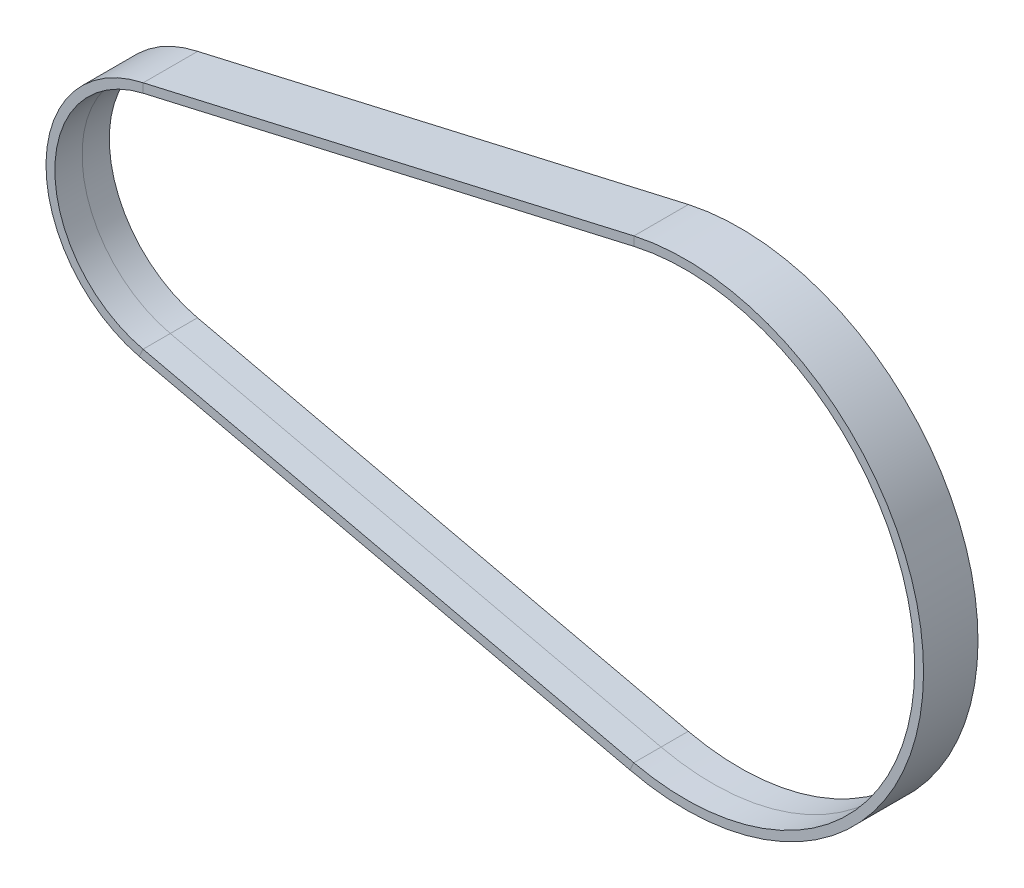
ISO-10303-21;
HEADER;
FILE_DESCRIPTION(('STEP AP214'),'2;1');
FILE_NAME('part.step','',(''),(''),'','','');
FILE_SCHEMA(('AUTOMOTIVE_DESIGN { 1 0 10303 214 1 1 1 1 }'));
ENDSEC;
DATA;
#1=APPLICATION_CONTEXT('core data for automotive mechanical design processes');
#2=APPLICATION_PROTOCOL_DEFINITION('international standard','automotive_design',2000,#1);
#3=PRODUCT_CONTEXT('',#1,'mechanical');
#4=PRODUCT('Part','Part','',(#3));
#5=PRODUCT_RELATED_PRODUCT_CATEGORY('part','',(#4));
#6=PRODUCT_DEFINITION_FORMATION('','',#4);
#7=PRODUCT_DEFINITION_CONTEXT('part definition',#1,'design');
#8=PRODUCT_DEFINITION('design','',#6,#7);
#9=PRODUCT_DEFINITION_SHAPE('','',#8);
#10=(LENGTH_UNIT() NAMED_UNIT(*) SI_UNIT(.MILLI.,.METRE.));
#11=(NAMED_UNIT(*) PLANE_ANGLE_UNIT() SI_UNIT($,.RADIAN.));
#12=(NAMED_UNIT(*) SI_UNIT($,.STERADIAN.) SOLID_ANGLE_UNIT());
#13=UNCERTAINTY_MEASURE_WITH_UNIT(LENGTH_MEASURE(1.E-05),#10,'distance_accuracy_value','');
#14=(GEOMETRIC_REPRESENTATION_CONTEXT(3) GLOBAL_UNCERTAINTY_ASSIGNED_CONTEXT((#13)) GLOBAL_UNIT_ASSIGNED_CONTEXT((#10,
#11,#12)) REPRESENTATION_CONTEXT('',''));
#15=CARTESIAN_POINT('',(0.,0.,0.));
#16=DIRECTION('',(0.,0.,1.));
#17=DIRECTION('',(1.,0.,0.));
#18=AXIS2_PLACEMENT_3D('',#15,#16,#17);
#19=CARTESIAN_POINT('',(-3.25164833273085,-13.1156696536498,-3.));
#20=DIRECTION('',(0.,0.,-1.));
#21=DIRECTION('',(-1.,0.,0.));
#22=AXIS2_PLACEMENT_3D('',#19,#20,#21);
#23=PLANE('',#22);
#24=CARTESIAN_POINT('',(0.,0.,-3.));
#25=DIRECTION('',(0.,0.,-1.));
#26=DIRECTION('',(-0.22456525321064,-0.974459053552503,0.));
#27=AXIS2_PLACEMENT_3D('',#24,#25,#26);
#28=CIRCLE('',#27,12.5361346548221);
#29=CARTESIAN_POINT('',(-2.8151802530428,-12.2159499109446,-3.));
#30=VERTEX_POINT('',#29);
#31=CARTESIAN_POINT('',(-2.79899894625922,12.2196676297954,-3.));
#32=VERTEX_POINT('',#31);
#33=EDGE_CURVE('E11',#30,#32,#28,.T.);
#34=ORIENTED_EDGE('',*,*,#33,.F.);
#35=DIRECTION('',(-0.436468079688057,-0.899719742705149,0.));
#36=VECTOR('',#35,1.);
#37=CARTESIAN_POINT('',(-3.25164833273085,-13.1156696536498,-3.));
#38=LINE('',#37,#36);
#39=CARTESIAN_POINT('',(-3.25164833273086,-13.1156696536498,-3.));
#40=VERTEX_POINT('',#39);
#41=EDGE_CURVE('E42',#30,#40,#38,.T.);
#42=ORIENTED_EDGE('',*,*,#41,.T.);
#43=CARTESIAN_POINT('',(0.,0.,-3.));
#44=DIRECTION('',(0.,0.,-1.));
#45=DIRECTION('',(-0.24063583954527,-0.970615471093648,0.));
#46=AXIS2_PLACEMENT_3D('',#43,#44,#45);
#47=CIRCLE('',#46,13.5127350060386);
#48=CARTESIAN_POINT('',(-2.79899894625922,13.2196676297954,-3.));
#49=VERTEX_POINT('',#48);
#50=EDGE_CURVE('E143',#40,#49,#47,.T.);
#51=ORIENTED_EDGE('',*,*,#50,.T.);
#52=DIRECTION('',(0.,1.,0.));
#53=VECTOR('',#52,1.);
#54=CARTESIAN_POINT('',(-2.79899894625922,13.2196676297954,-3.));
#55=LINE('',#54,#53);
#56=EDGE_CURVE('E146',#32,#49,#55,.T.);
#57=ORIENTED_EDGE('',*,*,#56,.F.);
#58=EDGE_LOOP('',(#34,#42,#51,#57));
#59=FACE_BOUND('',#58,.T.);
#60=ADVANCED_FACE('F39',(#59),#23,.T.);
#61=CARTESIAN_POINT('',(0.,0.,0.));
#62=DIRECTION('',(0.,0.,-1.));
#63=DIRECTION('',(-1.,0.,0.));
#64=AXIS2_PLACEMENT_3D('',#61,#62,#63);
#65=CYLINDRICAL_SURFACE('',#64,12.5361346548221);
#66=CARTESIAN_POINT('',(0.,0.,0.));
#67=DIRECTION('',(0.,0.,-1.));
#68=DIRECTION('',(-0.22456525321064,-0.974459053552503,0.));
#69=AXIS2_PLACEMENT_3D('',#66,#67,#68);
#70=CIRCLE('',#69,12.5361346548221);
#71=CARTESIAN_POINT('',(-2.8151802530428,-12.2159499109446,0.));
#72=VERTEX_POINT('',#71);
#73=CARTESIAN_POINT('',(-2.79899894625922,12.2196676297954,0.));
#74=VERTEX_POINT('',#73);
#75=EDGE_CURVE('E48',#72,#74,#70,.T.);
#76=ORIENTED_EDGE('',*,*,#75,.F.);
#77=DIRECTION('',(0.,0.,-1.));
#78=VECTOR('',#77,1.);
#79=CARTESIAN_POINT('',(-2.81518025304279,-12.2159499109446,-3.));
#80=LINE('',#79,#78);
#81=EDGE_CURVE('E258',#72,#30,#80,.T.);
#82=ORIENTED_EDGE('',*,*,#81,.T.);
#83=ORIENTED_EDGE('',*,*,#33,.T.);
#84=DIRECTION('',(0.,0.,-1.));
#85=VECTOR('',#84,1.);
#86=CARTESIAN_POINT('',(-2.79899894625922,12.2196676297954,-3.));
#87=LINE('',#86,#85);
#88=EDGE_CURVE('E170',#74,#32,#87,.T.);
#89=ORIENTED_EDGE('',*,*,#88,.F.);
#90=EDGE_LOOP('',(#76,#82,#83,#89));
#91=FACE_BOUND('',#90,.T.);
#92=ADVANCED_FACE('F310',(#91),#65,.F.);
#93=CARTESIAN_POINT('',(0.,0.,0.));
#94=DIRECTION('',(0.,0.,-1.));
#95=DIRECTION('',(-1.,0.,0.));
#96=AXIS2_PLACEMENT_3D('',#93,#94,#95);
#97=CYLINDRICAL_SURFACE('',#96,12.5361346548221);
#98=CARTESIAN_POINT('',(0.,0.,3.));
#99=DIRECTION('',(0.,0.,-1.));
#100=DIRECTION('',(-0.22456525321064,-0.974459053552503,0.));
#101=AXIS2_PLACEMENT_3D('',#98,#99,#100);
#102=CIRCLE('',#101,12.5361346548221);
#103=CARTESIAN_POINT('',(-2.8151802530428,-12.2159499109446,3.));
#104=VERTEX_POINT('',#103);
#105=CARTESIAN_POINT('',(-2.79899894625922,12.2196676297954,3.));
#106=VERTEX_POINT('',#105);
#107=EDGE_CURVE('E132',#104,#106,#102,.T.);
#108=ORIENTED_EDGE('',*,*,#107,.F.);
#109=DIRECTION('',(0.,0.,-1.));
#110=VECTOR('',#109,1.);
#111=CARTESIAN_POINT('',(-2.81518025304279,-12.2159499109446,0.));
#112=LINE('',#111,#110);
#113=EDGE_CURVE('E232',#104,#72,#112,.T.);
#114=ORIENTED_EDGE('',*,*,#113,.T.);
#115=ORIENTED_EDGE('',*,*,#75,.T.);
#116=DIRECTION('',(0.,0.,-1.));
#117=VECTOR('',#116,1.);
#118=CARTESIAN_POINT('',(-2.79899894625922,12.2196676297954,0.));
#119=LINE('',#118,#117);
#120=EDGE_CURVE('E178',#106,#74,#119,.T.);
#121=ORIENTED_EDGE('',*,*,#120,.F.);
#122=EDGE_LOOP('',(#108,#114,#115,#121));
#123=FACE_BOUND('',#122,.T.);
#124=ADVANCED_FACE('F314',(#123),#97,.F.);
#125=CARTESIAN_POINT('',(-2.8151802530428,-12.2159499109446,3.));
#126=DIRECTION('',(0.,0.,1.));
#127=DIRECTION('',(1.,0.,0.));
#128=AXIS2_PLACEMENT_3D('',#125,#126,#127);
#129=PLANE('',#128);
#130=CARTESIAN_POINT('',(0.,0.,3.));
#131=DIRECTION('',(0.,0.,-1.));
#132=DIRECTION('',(-0.24063583954527,-0.970615471093648,0.));
#133=AXIS2_PLACEMENT_3D('',#130,#131,#132);
#134=CIRCLE('',#133,13.5127350060386);
#135=CARTESIAN_POINT('',(-3.25164833273086,-13.1156696536498,3.));
#136=VERTEX_POINT('',#135);
#137=CARTESIAN_POINT('',(-2.79899894625922,13.2196676297954,3.));
#138=VERTEX_POINT('',#137);
#139=EDGE_CURVE('E139',#136,#138,#134,.T.);
#140=ORIENTED_EDGE('',*,*,#139,.F.);
#141=DIRECTION('',(0.436468079688057,0.899719742705149,0.));
#142=VECTOR('',#141,1.);
#143=CARTESIAN_POINT('',(-2.81518025304279,-12.2159499109446,3.));
#144=LINE('',#143,#142);
#145=EDGE_CURVE('E206',#136,#104,#144,.T.);
#146=ORIENTED_EDGE('',*,*,#145,.T.);
#147=ORIENTED_EDGE('',*,*,#107,.T.);
#148=DIRECTION('',(0.,-1.,0.));
#149=VECTOR('',#148,1.);
#150=CARTESIAN_POINT('',(-2.79899894625922,12.2196676297954,3.));
#151=LINE('',#150,#149);
#152=EDGE_CURVE('E174',#138,#106,#151,.T.);
#153=ORIENTED_EDGE('',*,*,#152,.F.);
#154=EDGE_LOOP('',(#140,#146,#147,#153));
#155=FACE_BOUND('',#154,.T.);
#156=ADVANCED_FACE('F319',(#155),#129,.T.);
#157=CARTESIAN_POINT('',(50.8333727420847,-25.5419158823688,-3.));
#158=DIRECTION('',(0.,0.,-1.));
#159=DIRECTION('',(-1.,0.,0.));
#160=AXIS2_PLACEMENT_3D('',#157,#158,#159);
#161=PLANE('',#160);
#162=ORIENTED_EDGE('',*,*,#41,.F.);
#163=DIRECTION('',(-0.974607547350509,0.223919915700738,0.));
#164=VECTOR('',#163,1.);
#165=CARTESIAN_POINT('',(51.2698408217728,-24.6421961396636,-3.));
#166=LINE('',#165,#164);
#167=CARTESIAN_POINT('',(51.2698408217728,-24.6421961396636,-3.));
#168=VERTEX_POINT('',#167);
#169=EDGE_CURVE('E274',#168,#30,#166,.T.);
#170=ORIENTED_EDGE('',*,*,#169,.F.);
#171=DIRECTION('',(-0.436468079688057,-0.899719742705149,0.));
#172=VECTOR('',#171,1.);
#173=CARTESIAN_POINT('',(50.8333727420847,-25.5419158823688,-3.));
#174=LINE('',#173,#172);
#175=CARTESIAN_POINT('',(50.8333727420848,-25.5419158823688,-3.));
#176=VERTEX_POINT('',#175);
#177=EDGE_CURVE('E210',#168,#176,#174,.T.);
#178=ORIENTED_EDGE('',*,*,#177,.T.);
#179=DIRECTION('',(-0.974607547350509,0.223919915700738,0.));
#180=VECTOR('',#179,1.);
#181=CARTESIAN_POINT('',(50.8333727420847,-25.5419158823688,-3.));
#182=LINE('',#181,#180);
#183=EDGE_CURVE('E202',#176,#40,#182,.T.);
#184=ORIENTED_EDGE('',*,*,#183,.T.);
#185=EDGE_LOOP('',(#162,#170,#178,#184));
#186=FACE_BOUND('',#185,.T.);
#187=ADVANCED_FACE('F285',(#186),#161,.T.);
#188=CARTESIAN_POINT('',(51.2698408217728,-24.6421961396636,-3.));
#189=DIRECTION('',(0.223919915700738,0.974607547350509,0.));
#190=DIRECTION('',(-0.974607547350509,0.223919915700738,0.));
#191=AXIS2_PLACEMENT_3D('',#188,#189,#190);
#192=PLANE('',#191);
#193=ORIENTED_EDGE('',*,*,#169,.T.);
#194=ORIENTED_EDGE('',*,*,#81,.F.);
#195=DIRECTION('',(-0.974607547350509,0.223919915700738,0.));
#196=VECTOR('',#195,1.);
#197=CARTESIAN_POINT('',(51.2698408217728,-24.6421961396636,0.));
#198=LINE('',#197,#196);
#199=CARTESIAN_POINT('',(51.2698408217728,-24.6421961396636,0.));
#200=VERTEX_POINT('',#199);
#201=EDGE_CURVE('E254',#200,#72,#198,.T.);
#202=ORIENTED_EDGE('',*,*,#201,.F.);
#203=DIRECTION('',(0.,0.,-1.));
#204=VECTOR('',#203,1.);
#205=CARTESIAN_POINT('',(51.2698408217728,-24.6421961396636,-3.));
#206=LINE('',#205,#204);
#207=EDGE_CURVE('E248',#200,#168,#206,.T.);
#208=ORIENTED_EDGE('',*,*,#207,.T.);
#209=EDGE_LOOP('',(#193,#194,#202,#208));
#210=FACE_BOUND('',#209,.T.);
#211=ADVANCED_FACE('F324',(#210),#192,.T.);
#212=CARTESIAN_POINT('',(51.2698408217728,-24.6421961396636,0.));
#213=DIRECTION('',(0.223919915700738,0.974607547350509,0.));
#214=DIRECTION('',(-0.974607547350509,0.223919915700738,0.));
#215=AXIS2_PLACEMENT_3D('',#212,#213,#214);
#216=PLANE('',#215);
#217=ORIENTED_EDGE('',*,*,#201,.T.);
#218=ORIENTED_EDGE('',*,*,#113,.F.);
#219=DIRECTION('',(-0.974607547350509,0.223919915700738,0.));
#220=VECTOR('',#219,1.);
#221=CARTESIAN_POINT('',(51.2698408217728,-24.6421961396636,3.));
#222=LINE('',#221,#220);
#223=CARTESIAN_POINT('',(51.2698408217728,-24.6421961396636,3.));
#224=VERTEX_POINT('',#223);
#225=EDGE_CURVE('E228',#224,#104,#222,.T.);
#226=ORIENTED_EDGE('',*,*,#225,.F.);
#227=DIRECTION('',(0.,0.,-1.));
#228=VECTOR('',#227,1.);
#229=CARTESIAN_POINT('',(51.2698408217728,-24.6421961396636,0.));
#230=LINE('',#229,#228);
#231=EDGE_CURVE('E223',#224,#200,#230,.T.);
#232=ORIENTED_EDGE('',*,*,#231,.T.);
#233=EDGE_LOOP('',(#217,#218,#226,#232));
#234=FACE_BOUND('',#233,.T.);
#235=ADVANCED_FACE('F336',(#234),#216,.T.);
#236=CARTESIAN_POINT('',(51.2698408217728,-24.6421961396636,3.));
#237=DIRECTION('',(0.,0.,1.));
#238=DIRECTION('',(1.,0.,0.));
#239=AXIS2_PLACEMENT_3D('',#236,#237,#238);
#240=PLANE('',#239);
#241=ORIENTED_EDGE('',*,*,#225,.T.);
#242=ORIENTED_EDGE('',*,*,#145,.F.);
#243=DIRECTION('',(-0.974607547350509,0.223919915700738,0.));
#244=VECTOR('',#243,1.);
#245=CARTESIAN_POINT('',(50.8333727420847,-25.5419158823688,3.));
#246=LINE('',#245,#244);
#247=CARTESIAN_POINT('',(50.8333727420848,-25.5419158823688,3.));
#248=VERTEX_POINT('',#247);
#249=EDGE_CURVE('E201',#248,#136,#246,.T.);
#250=ORIENTED_EDGE('',*,*,#249,.F.);
#251=DIRECTION('',(0.436468079688057,0.899719742705149,0.));
#252=VECTOR('',#251,1.);
#253=CARTESIAN_POINT('',(51.2698408217728,-24.6421961396636,3.));
#254=LINE('',#253,#252);
#255=EDGE_CURVE('E191',#248,#224,#254,.T.);
#256=ORIENTED_EDGE('',*,*,#255,.T.);
#257=EDGE_LOOP('',(#241,#242,#250,#256));
#258=FACE_BOUND('',#257,.T.);
#259=ADVANCED_FACE('F295',(#258),#240,.T.);
#260=CARTESIAN_POINT('',(50.8333727420847,-25.5419158823688,3.));
#261=DIRECTION('',(-0.223919915700738,-0.974607547350509,0.));
#262=DIRECTION('',(0.974607547350509,-0.223919915700738,0.));
#263=AXIS2_PLACEMENT_3D('',#260,#261,#262);
#264=PLANE('',#263);
#265=ORIENTED_EDGE('',*,*,#249,.T.);
#266=DIRECTION('',(0.,0.,1.));
#267=VECTOR('',#266,1.);
#268=CARTESIAN_POINT('',(-3.25164833273085,-13.1156696536498,3.));
#269=LINE('',#268,#267);
#270=EDGE_CURVE('E198',#40,#136,#269,.T.);
#271=ORIENTED_EDGE('',*,*,#270,.F.);
#272=ORIENTED_EDGE('',*,*,#183,.F.);
#273=DIRECTION('',(0.,0.,1.));
#274=VECTOR('',#273,1.);
#275=CARTESIAN_POINT('',(50.8333727420847,-25.5419158823688,3.));
#276=LINE('',#275,#274);
#277=EDGE_CURVE('E187',#176,#248,#276,.T.);
#278=ORIENTED_EDGE('',*,*,#277,.T.);
#279=EDGE_LOOP('',(#265,#271,#272,#278));
#280=FACE_BOUND('',#279,.T.);
#281=ADVANCED_FACE('F292',(#280),#264,.T.);
#282=CARTESIAN_POINT('',(51.2860221285564,25.6459138585144,-3.));
#283=DIRECTION('',(0.,0.,-1.));
#284=DIRECTION('',(-1.,0.,0.));
#285=AXIS2_PLACEMENT_3D('',#282,#283,#284);
#286=PLANE('',#285);
#287=ORIENTED_EDGE('',*,*,#177,.F.);
#288=CARTESIAN_POINT('',(56.94,0.,-3.));
#289=DIRECTION('',(0.,0.,-1.));
#290=DIRECTION('',(-0.223599939592176,0.974681007824804,0.));
#291=AXIS2_PLACEMENT_3D('',#288,#289,#290);
#292=CIRCLE('',#291,25.2861332688904);
#293=CARTESIAN_POINT('',(51.2860221285564,24.6459138585144,-3.));
#294=VERTEX_POINT('',#293);
#295=EDGE_CURVE('E85',#294,#168,#292,.T.);
#296=ORIENTED_EDGE('',*,*,#295,.F.);
#297=DIRECTION('',(0.,1.,0.));
#298=VECTOR('',#297,1.);
#299=CARTESIAN_POINT('',(51.2860221285564,25.6459138585144,-3.));
#300=LINE('',#299,#298);
#301=CARTESIAN_POINT('',(51.2860221285564,25.6459138585144,-3.));
#302=VERTEX_POINT('',#301);
#303=EDGE_CURVE('E197',#294,#302,#300,.T.);
#304=ORIENTED_EDGE('',*,*,#303,.T.);
#305=CARTESIAN_POINT('',(56.94,0.,-3.));
#306=DIRECTION('',(0.,0.,-1.));
#307=DIRECTION('',(-0.215293131108368,0.976549470174223,0.));
#308=AXIS2_PLACEMENT_3D('',#305,#306,#307);
#309=CIRCLE('',#308,26.2617661898265);
#310=EDGE_CURVE('E194',#302,#176,#309,.T.);
#311=ORIENTED_EDGE('',*,*,#310,.T.);
#312=EDGE_LOOP('',(#287,#296,#304,#311));
#313=FACE_BOUND('',#312,.T.);
#314=ADVANCED_FACE('F329',(#313),#286,.T.);
#315=CARTESIAN_POINT('',(56.94,0.,0.));
#316=DIRECTION('',(0.,0.,-1.));
#317=DIRECTION('',(-1.,0.,0.));
#318=AXIS2_PLACEMENT_3D('',#315,#316,#317);
#319=CYLINDRICAL_SURFACE('',#318,25.2861332688904);
#320=ORIENTED_EDGE('',*,*,#295,.T.);
#321=ORIENTED_EDGE('',*,*,#207,.F.);
#322=CARTESIAN_POINT('',(56.94,0.,0.));
#323=DIRECTION('',(0.,0.,-1.));
#324=DIRECTION('',(-0.223599939592176,0.974681007824804,0.));
#325=AXIS2_PLACEMENT_3D('',#322,#323,#324);
#326=CIRCLE('',#325,25.2861332688904);
#327=CARTESIAN_POINT('',(51.2860221285564,24.6459138585144,0.));
#328=VERTEX_POINT('',#327);
#329=EDGE_CURVE('E95',#328,#200,#326,.T.);
#330=ORIENTED_EDGE('',*,*,#329,.F.);
#331=DIRECTION('',(0.,0.,-1.));
#332=VECTOR('',#331,1.);
#333=CARTESIAN_POINT('',(51.2860221285564,24.6459138585144,-3.));
#334=LINE('',#333,#332);
#335=EDGE_CURVE('E244',#328,#294,#334,.T.);
#336=ORIENTED_EDGE('',*,*,#335,.T.);
#337=EDGE_LOOP('',(#320,#321,#330,#336));
#338=FACE_BOUND('',#337,.T.);
#339=ADVANCED_FACE('F305',(#338),#319,.F.);
#340=CARTESIAN_POINT('',(56.94,0.,0.));
#341=DIRECTION('',(0.,0.,-1.));
#342=DIRECTION('',(-1.,0.,0.));
#343=AXIS2_PLACEMENT_3D('',#340,#341,#342);
#344=CYLINDRICAL_SURFACE('',#343,25.2861332688904);
#345=ORIENTED_EDGE('',*,*,#329,.T.);
#346=ORIENTED_EDGE('',*,*,#231,.F.);
#347=CARTESIAN_POINT('',(56.94,0.,3.));
#348=DIRECTION('',(0.,0.,-1.));
#349=DIRECTION('',(-0.223599939592176,0.974681007824804,0.));
#350=AXIS2_PLACEMENT_3D('',#347,#348,#349);
#351=CIRCLE('',#350,25.2861332688904);
#352=CARTESIAN_POINT('',(51.2860221285564,24.6459138585144,3.));
#353=VERTEX_POINT('',#352);
#354=EDGE_CURVE('E104',#353,#224,#351,.T.);
#355=ORIENTED_EDGE('',*,*,#354,.F.);
#356=DIRECTION('',(0.,0.,-1.));
#357=VECTOR('',#356,1.);
#358=CARTESIAN_POINT('',(51.2860221285564,24.6459138585144,0.));
#359=LINE('',#358,#357);
#360=EDGE_CURVE('E219',#353,#328,#359,.T.);
#361=ORIENTED_EDGE('',*,*,#360,.T.);
#362=EDGE_LOOP('',(#345,#346,#355,#361));
#363=FACE_BOUND('',#362,.T.);
#364=ADVANCED_FACE('F298',(#363),#344,.F.);
#365=CARTESIAN_POINT('',(51.2860221285564,24.6459138585144,3.));
#366=DIRECTION('',(0.,0.,1.));
#367=DIRECTION('',(1.,0.,0.));
#368=AXIS2_PLACEMENT_3D('',#365,#366,#367);
#369=PLANE('',#368);
#370=ORIENTED_EDGE('',*,*,#354,.T.);
#371=ORIENTED_EDGE('',*,*,#255,.F.);
#372=CARTESIAN_POINT('',(56.94,0.,3.));
#373=DIRECTION('',(0.,0.,-1.));
#374=DIRECTION('',(-0.215293131108368,0.976549470174223,0.));
#375=AXIS2_PLACEMENT_3D('',#372,#373,#374);
#376=CIRCLE('',#375,26.2617661898265);
#377=CARTESIAN_POINT('',(51.2860221285564,25.6459138585144,3.));
#378=VERTEX_POINT('',#377);
#379=EDGE_CURVE('E118',#378,#248,#376,.T.);
#380=ORIENTED_EDGE('',*,*,#379,.F.);
#381=DIRECTION('',(0.,-1.,0.));
#382=VECTOR('',#381,1.);
#383=CARTESIAN_POINT('',(51.2860221285564,24.6459138585144,3.));
#384=LINE('',#383,#382);
#385=EDGE_CURVE('E185',#378,#353,#384,.T.);
#386=ORIENTED_EDGE('',*,*,#385,.T.);
#387=EDGE_LOOP('',(#370,#371,#380,#386));
#388=FACE_BOUND('',#387,.T.);
#389=ADVANCED_FACE('F296',(#388),#369,.T.);
#390=CARTESIAN_POINT('',(56.94,0.,0.));
#391=DIRECTION('',(0.,0.,-1.));
#392=DIRECTION('',(-1.,0.,0.));
#393=AXIS2_PLACEMENT_3D('',#390,#391,#392);
#394=CYLINDRICAL_SURFACE('',#393,26.2617661898265);
#395=ORIENTED_EDGE('',*,*,#379,.T.);
#396=ORIENTED_EDGE('',*,*,#277,.F.);
#397=ORIENTED_EDGE('',*,*,#310,.F.);
#398=DIRECTION('',(0.,0.,1.));
#399=VECTOR('',#398,1.);
#400=CARTESIAN_POINT('',(51.2860221285564,25.6459138585144,3.));
#401=LINE('',#400,#399);
#402=EDGE_CURVE('E160',#302,#378,#401,.T.);
#403=ORIENTED_EDGE('',*,*,#402,.T.);
#404=EDGE_LOOP('',(#395,#396,#397,#403));
#405=FACE_BOUND('',#404,.T.);
#406=ADVANCED_FACE('F289',(#405),#394,.T.);
#407=CARTESIAN_POINT('',(-2.79899894625922,13.2196676297954,-3.));
#408=DIRECTION('',(0.,0.,-1.));
#409=DIRECTION('',(-1.,0.,0.));
#410=AXIS2_PLACEMENT_3D('',#407,#408,#409);
#411=PLANE('',#410);
#412=ORIENTED_EDGE('',*,*,#303,.F.);
#413=DIRECTION('',(0.974607547350509,0.223919915700738,0.));
#414=VECTOR('',#413,1.);
#415=CARTESIAN_POINT('',(-2.79899894625922,12.2196676297954,-3.));
#416=LINE('',#415,#414);
#417=EDGE_CURVE('E168',#32,#294,#416,.T.);
#418=ORIENTED_EDGE('',*,*,#417,.F.);
#419=ORIENTED_EDGE('',*,*,#56,.T.);
#420=DIRECTION('',(0.974607547350509,0.223919915700738,0.));
#421=VECTOR('',#420,1.);
#422=CARTESIAN_POINT('',(-2.79899894625922,13.2196676297954,-3.));
#423=LINE('',#422,#421);
#424=EDGE_CURVE('E155',#49,#302,#423,.T.);
#425=ORIENTED_EDGE('',*,*,#424,.T.);
#426=EDGE_LOOP('',(#412,#418,#419,#425));
#427=FACE_BOUND('',#426,.T.);
#428=ADVANCED_FACE('F166',(#427),#411,.T.);
#429=CARTESIAN_POINT('',(-2.79899894625922,12.2196676297954,-3.));
#430=DIRECTION('',(0.223919915700738,-0.974607547350509,0.));
#431=DIRECTION('',(0.974607547350509,0.223919915700738,0.));
#432=AXIS2_PLACEMENT_3D('',#429,#430,#431);
#433=PLANE('',#432);
#434=ORIENTED_EDGE('',*,*,#417,.T.);
#435=ORIENTED_EDGE('',*,*,#335,.F.);
#436=DIRECTION('',(0.974607547350509,0.223919915700738,0.));
#437=VECTOR('',#436,1.);
#438=CARTESIAN_POINT('',(-2.79899894625922,12.2196676297954,0.));
#439=LINE('',#438,#437);
#440=EDGE_CURVE('E240',#74,#328,#439,.T.);
#441=ORIENTED_EDGE('',*,*,#440,.F.);
#442=ORIENTED_EDGE('',*,*,#88,.T.);
#443=EDGE_LOOP('',(#434,#435,#441,#442));
#444=FACE_BOUND('',#443,.T.);
#445=ADVANCED_FACE('F328',(#444),#433,.T.);
#446=CARTESIAN_POINT('',(-2.79899894625922,12.2196676297954,0.));
#447=DIRECTION('',(0.223919915700738,-0.974607547350509,0.));
#448=DIRECTION('',(0.974607547350509,0.223919915700738,0.));
#449=AXIS2_PLACEMENT_3D('',#446,#447,#448);
#450=PLANE('',#449);
#451=ORIENTED_EDGE('',*,*,#440,.T.);
#452=ORIENTED_EDGE('',*,*,#360,.F.);
#453=DIRECTION('',(0.974607547350509,0.223919915700738,0.));
#454=VECTOR('',#453,1.);
#455=CARTESIAN_POINT('',(-2.79899894625922,12.2196676297954,3.));
#456=LINE('',#455,#454);
#457=EDGE_CURVE('E215',#106,#353,#456,.T.);
#458=ORIENTED_EDGE('',*,*,#457,.F.);
#459=ORIENTED_EDGE('',*,*,#120,.T.);
#460=EDGE_LOOP('',(#451,#452,#458,#459));
#461=FACE_BOUND('',#460,.T.);
#462=ADVANCED_FACE('F342',(#461),#450,.T.);
#463=CARTESIAN_POINT('',(-2.79899894625922,12.2196676297954,3.));
#464=DIRECTION('',(0.,0.,1.));
#465=DIRECTION('',(1.,0.,0.));
#466=AXIS2_PLACEMENT_3D('',#463,#464,#465);
#467=PLANE('',#466);
#468=ORIENTED_EDGE('',*,*,#457,.T.);
#469=ORIENTED_EDGE('',*,*,#385,.F.);
#470=DIRECTION('',(0.974607547350509,0.223919915700738,0.));
#471=VECTOR('',#470,1.);
#472=CARTESIAN_POINT('',(-2.79899894625922,13.2196676297954,3.));
#473=LINE('',#472,#471);
#474=EDGE_CURVE('E183',#138,#378,#473,.T.);
#475=ORIENTED_EDGE('',*,*,#474,.F.);
#476=ORIENTED_EDGE('',*,*,#152,.T.);
#477=EDGE_LOOP('',(#468,#469,#475,#476));
#478=FACE_BOUND('',#477,.T.);
#479=ADVANCED_FACE('F344',(#478),#467,.T.);
#480=CARTESIAN_POINT('',(-2.79899894625922,13.2196676297954,3.));
#481=DIRECTION('',(-0.223919915700738,0.974607547350509,0.));
#482=DIRECTION('',(-0.974607547350509,-0.223919915700738,0.));
#483=AXIS2_PLACEMENT_3D('',#480,#481,#482);
#484=PLANE('',#483);
#485=ORIENTED_EDGE('',*,*,#474,.T.);
#486=ORIENTED_EDGE('',*,*,#402,.F.);
#487=ORIENTED_EDGE('',*,*,#424,.F.);
#488=DIRECTION('',(0.,0.,1.));
#489=VECTOR('',#488,1.);
#490=CARTESIAN_POINT('',(-2.79899894625922,13.2196676297954,3.));
#491=LINE('',#490,#489);
#492=EDGE_CURVE('E158',#49,#138,#491,.T.);
#493=ORIENTED_EDGE('',*,*,#492,.T.);
#494=EDGE_LOOP('',(#485,#486,#487,#493));
#495=FACE_BOUND('',#494,.T.);
#496=ADVANCED_FACE('F157',(#495),#484,.T.);
#497=CARTESIAN_POINT('',(0.,0.,0.));
#498=DIRECTION('',(0.,0.,-1.));
#499=DIRECTION('',(-1.,0.,0.));
#500=AXIS2_PLACEMENT_3D('',#497,#498,#499);
#501=CYLINDRICAL_SURFACE('',#500,13.5127350060386);
#502=ORIENTED_EDGE('',*,*,#270,.T.);
#503=ORIENTED_EDGE('',*,*,#139,.T.);
#504=ORIENTED_EDGE('',*,*,#492,.F.);
#505=ORIENTED_EDGE('',*,*,#50,.F.);
#506=EDGE_LOOP('',(#502,#503,#504,#505));
#507=FACE_BOUND('',#506,.T.);
#508=ADVANCED_FACE('F172',(#507),#501,.T.);
#509=CLOSED_SHELL('',(#60,#92,#124,#156,#187,#211,#235,#259,#281,#314,#339,#364,#389,#406,#428,
#445,#462,#479,#496,#508));
#510=MANIFOLD_SOLID_BREP('B2',#509);
#511=ADVANCED_BREP_SHAPE_REPRESENTATION('',(#18,#510),#14);
#512=SHAPE_DEFINITION_REPRESENTATION(#9,#511);
ENDSEC;
END-ISO-10303-21;
